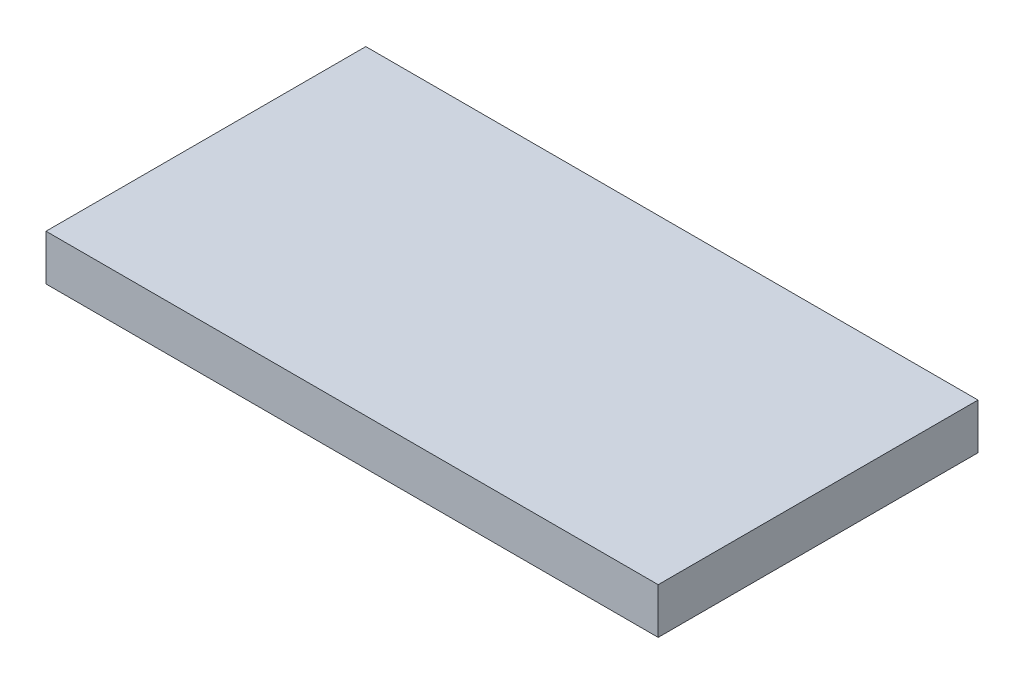
ISO-10303-21;
HEADER;
FILE_DESCRIPTION(('STEP AP214'),'2;1');
FILE_NAME('part.step','',(''),(''),'','','');
FILE_SCHEMA(('AUTOMOTIVE_DESIGN { 1 0 10303 214 1 1 1 1 }'));
ENDSEC;
DATA;
#1=APPLICATION_CONTEXT('core data for automotive mechanical design processes');
#2=APPLICATION_PROTOCOL_DEFINITION('international standard','automotive_design',2000,#1);
#3=PRODUCT_CONTEXT('',#1,'mechanical');
#4=PRODUCT('Part','Part','',(#3));
#5=PRODUCT_RELATED_PRODUCT_CATEGORY('part','',(#4));
#6=PRODUCT_DEFINITION_FORMATION('','',#4);
#7=PRODUCT_DEFINITION_CONTEXT('part definition',#1,'design');
#8=PRODUCT_DEFINITION('design','',#6,#7);
#9=PRODUCT_DEFINITION_SHAPE('','',#8);
#10=(LENGTH_UNIT() NAMED_UNIT(*) SI_UNIT(.MILLI.,.METRE.));
#11=(NAMED_UNIT(*) PLANE_ANGLE_UNIT() SI_UNIT($,.RADIAN.));
#12=(NAMED_UNIT(*) SI_UNIT($,.STERADIAN.) SOLID_ANGLE_UNIT());
#13=UNCERTAINTY_MEASURE_WITH_UNIT(LENGTH_MEASURE(1.E-05),#10,'distance_accuracy_value','');
#14=(GEOMETRIC_REPRESENTATION_CONTEXT(3) GLOBAL_UNCERTAINTY_ASSIGNED_CONTEXT((#13)) GLOBAL_UNIT_ASSIGNED_CONTEXT((#10,
#11,#12)) REPRESENTATION_CONTEXT('',''));
#15=CARTESIAN_POINT('',(0.,0.,0.));
#16=DIRECTION('',(0.,0.,1.));
#17=DIRECTION('',(1.,0.,0.));
#18=AXIS2_PLACEMENT_3D('',#15,#16,#17);
#19=CARTESIAN_POINT('',(0.,10.,0.));
#20=DIRECTION('',(1.,0.,0.));
#21=DIRECTION('',(0.,0.,-1.));
#22=AXIS2_PLACEMENT_3D('',#19,#20,#21);
#23=PLANE('',#22);
#24=DIRECTION('',(0.,0.,1.));
#25=VECTOR('',#24,1.);
#26=CARTESIAN_POINT('',(0.,0.,0.));
#27=LINE('',#26,#25);
#28=CARTESIAN_POINT('',(0.,0.,-70.));
#29=VERTEX_POINT('',#28);
#30=CARTESIAN_POINT('',(0.,0.,0.));
#31=VERTEX_POINT('',#30);
#32=EDGE_CURVE('E100',#29,#31,#27,.T.);
#33=ORIENTED_EDGE('',*,*,#32,.T.);
#34=DIRECTION('',(0.,-1.,0.));
#35=VECTOR('',#34,1.);
#36=CARTESIAN_POINT('',(0.,10.,0.));
#37=LINE('',#36,#35);
#38=CARTESIAN_POINT('',(0.,10.,0.));
#39=VERTEX_POINT('',#38);
#40=EDGE_CURVE('E11',#39,#31,#37,.T.);
#41=ORIENTED_EDGE('',*,*,#40,.F.);
#42=DIRECTION('',(0.,0.,1.));
#43=VECTOR('',#42,1.);
#44=CARTESIAN_POINT('',(0.,10.,0.));
#45=LINE('',#44,#43);
#46=CARTESIAN_POINT('',(0.,10.,-70.));
#47=VERTEX_POINT('',#46);
#48=EDGE_CURVE('E88',#47,#39,#45,.T.);
#49=ORIENTED_EDGE('',*,*,#48,.F.);
#50=DIRECTION('',(0.,-1.,0.));
#51=VECTOR('',#50,1.);
#52=CARTESIAN_POINT('',(0.,10.,-70.));
#53=LINE('',#52,#51);
#54=EDGE_CURVE('E96',#47,#29,#53,.T.);
#55=ORIENTED_EDGE('',*,*,#54,.T.);
#56=EDGE_LOOP('',(#33,#41,#49,#55));
#57=FACE_BOUND('',#56,.T.);
#58=ADVANCED_FACE('F37',(#57),#23,.F.);
#59=CARTESIAN_POINT('',(0.,10.,0.));
#60=DIRECTION('',(0.,0.,-1.));
#61=DIRECTION('',(-1.,0.,0.));
#62=AXIS2_PLACEMENT_3D('',#59,#60,#61);
#63=PLANE('',#62);
#64=DIRECTION('',(1.,0.,0.));
#65=VECTOR('',#64,1.);
#66=CARTESIAN_POINT('',(0.,0.,0.));
#67=LINE('',#66,#65);
#68=CARTESIAN_POINT('',(134.,0.,0.));
#69=VERTEX_POINT('',#68);
#70=EDGE_CURVE('E92',#31,#69,#67,.T.);
#71=ORIENTED_EDGE('',*,*,#70,.T.);
#72=DIRECTION('',(0.,-1.,0.));
#73=VECTOR('',#72,1.);
#74=CARTESIAN_POINT('',(134.,10.,0.));
#75=LINE('',#74,#73);
#76=CARTESIAN_POINT('',(134.,10.,0.));
#77=VERTEX_POINT('',#76);
#78=EDGE_CURVE('E45',#77,#69,#75,.T.);
#79=ORIENTED_EDGE('',*,*,#78,.F.);
#80=DIRECTION('',(1.,0.,0.));
#81=VECTOR('',#80,1.);
#82=CARTESIAN_POINT('',(0.,10.,0.));
#83=LINE('',#82,#81);
#84=EDGE_CURVE('E83',#39,#77,#83,.T.);
#85=ORIENTED_EDGE('',*,*,#84,.F.);
#86=ORIENTED_EDGE('',*,*,#40,.T.);
#87=EDGE_LOOP('',(#71,#79,#85,#86));
#88=FACE_BOUND('',#87,.T.);
#89=ADVANCED_FACE('F91',(#88),#63,.F.);
#90=CARTESIAN_POINT('',(134.,10.,0.));
#91=DIRECTION('',(-1.,0.,0.));
#92=DIRECTION('',(0.,0.,1.));
#93=AXIS2_PLACEMENT_3D('',#90,#91,#92);
#94=PLANE('',#93);
#95=DIRECTION('',(0.,0.,-1.));
#96=VECTOR('',#95,1.);
#97=CARTESIAN_POINT('',(134.,0.,0.));
#98=LINE('',#97,#96);
#99=CARTESIAN_POINT('',(134.,0.,-70.));
#100=VERTEX_POINT('',#99);
#101=EDGE_CURVE('E70',#69,#100,#98,.T.);
#102=ORIENTED_EDGE('',*,*,#101,.T.);
#103=DIRECTION('',(0.,-1.,0.));
#104=VECTOR('',#103,1.);
#105=CARTESIAN_POINT('',(134.,10.,-70.));
#106=LINE('',#105,#104);
#107=CARTESIAN_POINT('',(134.,10.,-70.));
#108=VERTEX_POINT('',#107);
#109=EDGE_CURVE('E93',#108,#100,#106,.T.);
#110=ORIENTED_EDGE('',*,*,#109,.F.);
#111=DIRECTION('',(0.,0.,-1.));
#112=VECTOR('',#111,1.);
#113=CARTESIAN_POINT('',(134.,10.,0.));
#114=LINE('',#113,#112);
#115=EDGE_CURVE('E86',#77,#108,#114,.T.);
#116=ORIENTED_EDGE('',*,*,#115,.F.);
#117=ORIENTED_EDGE('',*,*,#78,.T.);
#118=EDGE_LOOP('',(#102,#110,#116,#117));
#119=FACE_BOUND('',#118,.T.);
#120=ADVANCED_FACE('F94',(#119),#94,.F.);
#121=CARTESIAN_POINT('',(0.,10.,-70.));
#122=DIRECTION('',(0.,0.,1.));
#123=DIRECTION('',(1.,0.,0.));
#124=AXIS2_PLACEMENT_3D('',#121,#122,#123);
#125=PLANE('',#124);
#126=DIRECTION('',(-1.,0.,0.));
#127=VECTOR('',#126,1.);
#128=CARTESIAN_POINT('',(0.,0.,-70.));
#129=LINE('',#128,#127);
#130=EDGE_CURVE('E76',#100,#29,#129,.T.);
#131=ORIENTED_EDGE('',*,*,#130,.T.);
#132=ORIENTED_EDGE('',*,*,#54,.F.);
#133=DIRECTION('',(-1.,0.,0.));
#134=VECTOR('',#133,1.);
#135=CARTESIAN_POINT('',(0.,10.,-70.));
#136=LINE('',#135,#134);
#137=EDGE_CURVE('E53',#108,#47,#136,.T.);
#138=ORIENTED_EDGE('',*,*,#137,.F.);
#139=ORIENTED_EDGE('',*,*,#109,.T.);
#140=EDGE_LOOP('',(#131,#132,#138,#139));
#141=FACE_BOUND('',#140,.T.);
#142=ADVANCED_FACE('F107',(#141),#125,.F.);
#143=CARTESIAN_POINT('',(0.,10.,0.));
#144=DIRECTION('',(0.,-1.,0.));
#145=DIRECTION('',(0.,0.,-1.));
#146=AXIS2_PLACEMENT_3D('',#143,#144,#145);
#147=PLANE('',#146);
#148=ORIENTED_EDGE('',*,*,#48,.T.);
#149=ORIENTED_EDGE('',*,*,#84,.T.);
#150=ORIENTED_EDGE('',*,*,#115,.T.);
#151=ORIENTED_EDGE('',*,*,#137,.T.);
#152=EDGE_LOOP('',(#148,#149,#150,#151));
#153=FACE_BOUND('',#152,.T.);
#154=ADVANCED_FACE('F84',(#153),#147,.F.);
#155=CARTESIAN_POINT('',(0.,0.,0.));
#156=DIRECTION('',(0.,-1.,0.));
#157=DIRECTION('',(0.,0.,-1.));
#158=AXIS2_PLACEMENT_3D('',#155,#156,#157);
#159=PLANE('',#158);
#160=ORIENTED_EDGE('',*,*,#32,.F.);
#161=ORIENTED_EDGE('',*,*,#130,.F.);
#162=ORIENTED_EDGE('',*,*,#101,.F.);
#163=ORIENTED_EDGE('',*,*,#70,.F.);
#164=EDGE_LOOP('',(#160,#161,#162,#163));
#165=FACE_BOUND('',#164,.T.);
#166=ADVANCED_FACE('F110',(#165),#159,.T.);
#167=CLOSED_SHELL('',(#58,#89,#120,#142,#154,#166));
#168=MANIFOLD_SOLID_BREP('B2',#167);
#169=ADVANCED_BREP_SHAPE_REPRESENTATION('',(#18,#168),#14);
#170=SHAPE_DEFINITION_REPRESENTATION(#9,#169);
ENDSEC;
END-ISO-10303-21;
